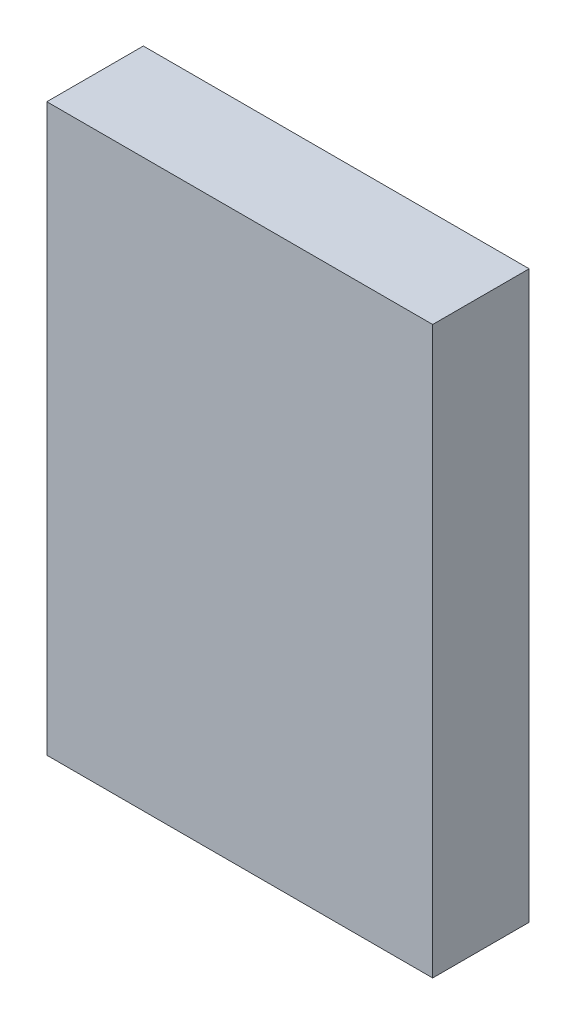
ISO-10303-21;
HEADER;
FILE_DESCRIPTION(('STEP AP214'),'2;1');
FILE_NAME('part.step','',(''),(''),'','','');
FILE_SCHEMA(('AUTOMOTIVE_DESIGN { 1 0 10303 214 1 1 1 1 }'));
ENDSEC;
DATA;
#1=APPLICATION_CONTEXT('core data for automotive mechanical design processes');
#2=APPLICATION_PROTOCOL_DEFINITION('international standard','automotive_design',2000,#1);
#3=PRODUCT_CONTEXT('',#1,'mechanical');
#4=PRODUCT('Part','Part','',(#3));
#5=PRODUCT_RELATED_PRODUCT_CATEGORY('part','',(#4));
#6=PRODUCT_DEFINITION_FORMATION('','',#4);
#7=PRODUCT_DEFINITION_CONTEXT('part definition',#1,'design');
#8=PRODUCT_DEFINITION('design','',#6,#7);
#9=PRODUCT_DEFINITION_SHAPE('','',#8);
#10=(LENGTH_UNIT() NAMED_UNIT(*) SI_UNIT(.MILLI.,.METRE.));
#11=(NAMED_UNIT(*) PLANE_ANGLE_UNIT() SI_UNIT($,.RADIAN.));
#12=(NAMED_UNIT(*) SI_UNIT($,.STERADIAN.) SOLID_ANGLE_UNIT());
#13=UNCERTAINTY_MEASURE_WITH_UNIT(LENGTH_MEASURE(1.E-05),#10,'distance_accuracy_value','');
#14=(GEOMETRIC_REPRESENTATION_CONTEXT(3) GLOBAL_UNCERTAINTY_ASSIGNED_CONTEXT((#13)) GLOBAL_UNIT_ASSIGNED_CONTEXT((#10,
#11,#12)) REPRESENTATION_CONTEXT('',''));
#15=CARTESIAN_POINT('',(0.,0.,0.));
#16=DIRECTION('',(0.,0.,1.));
#17=DIRECTION('',(1.,0.,0.));
#18=AXIS2_PLACEMENT_3D('',#15,#16,#17);
#19=CARTESIAN_POINT('',(-1.49949154,-2.19949014,0.));
#20=DIRECTION('',(0.,1.,0.));
#21=DIRECTION('',(1.,0.,0.));
#22=AXIS2_PLACEMENT_3D('',#19,#20,#21);
#23=PLANE('',#22);
#24=DIRECTION('',(1.,0.,0.));
#25=VECTOR('',#24,1.);
#26=CARTESIAN_POINT('',(-1.49949154,-2.19949014,0.));
#27=LINE('',#26,#25);
#28=CARTESIAN_POINT('',(-1.49949154,-2.19949014,0.));
#29=VERTEX_POINT('',#28);
#30=CARTESIAN_POINT('',(1.49949408,-2.19949014,0.));
#31=VERTEX_POINT('',#30);
#32=EDGE_CURVE('E11',#29,#31,#27,.T.);
#33=ORIENTED_EDGE('',*,*,#32,.T.);
#34=DIRECTION('',(0.,0.,1.));
#35=VECTOR('',#34,1.);
#36=CARTESIAN_POINT('',(1.49949408,-2.19949014,0.));
#37=LINE('',#36,#35);
#38=CARTESIAN_POINT('',(1.49949408,-2.19949014,0.75000104));
#39=VERTEX_POINT('',#38);
#40=EDGE_CURVE('E24',#31,#39,#37,.T.);
#41=ORIENTED_EDGE('',*,*,#40,.T.);
#42=DIRECTION('',(1.,0.,0.));
#43=VECTOR('',#42,1.);
#44=CARTESIAN_POINT('',(-1.49949154,-2.19949014,0.75000104));
#45=LINE('',#44,#43);
#46=CARTESIAN_POINT('',(-1.49949154,-2.19949014,0.75000104));
#47=VERTEX_POINT('',#46);
#48=EDGE_CURVE('E87',#47,#39,#45,.T.);
#49=ORIENTED_EDGE('',*,*,#48,.F.);
#50=DIRECTION('',(0.,0.,1.));
#51=VECTOR('',#50,1.);
#52=CARTESIAN_POINT('',(-1.49949154,-2.19949014,0.));
#53=LINE('',#52,#51);
#54=EDGE_CURVE('E36',#29,#47,#53,.T.);
#55=ORIENTED_EDGE('',*,*,#54,.F.);
#56=EDGE_LOOP('',(#33,#41,#49,#55));
#57=FACE_BOUND('',#56,.T.);
#58=ADVANCED_FACE('F17',(#57),#23,.F.);
#59=CARTESIAN_POINT('',(1.49949408,-2.19949014,0.));
#60=DIRECTION('',(-1.,0.,0.));
#61=DIRECTION('',(0.,1.,0.));
#62=AXIS2_PLACEMENT_3D('',#59,#60,#61);
#63=PLANE('',#62);
#64=DIRECTION('',(0.,1.,0.));
#65=VECTOR('',#64,1.);
#66=CARTESIAN_POINT('',(1.49949408,-2.19949014,0.));
#67=LINE('',#66,#65);
#68=CARTESIAN_POINT('',(1.49949408,2.19949268,0.));
#69=VERTEX_POINT('',#68);
#70=EDGE_CURVE('E84',#31,#69,#67,.T.);
#71=ORIENTED_EDGE('',*,*,#70,.T.);
#72=DIRECTION('',(0.,0.,1.));
#73=VECTOR('',#72,1.);
#74=CARTESIAN_POINT('',(1.49949408,2.19949268,0.));
#75=LINE('',#74,#73);
#76=CARTESIAN_POINT('',(1.49949408,2.19949268,0.75000104));
#77=VERTEX_POINT('',#76);
#78=EDGE_CURVE('E82',#69,#77,#75,.T.);
#79=ORIENTED_EDGE('',*,*,#78,.T.);
#80=DIRECTION('',(0.,1.,0.));
#81=VECTOR('',#80,1.);
#82=CARTESIAN_POINT('',(1.49949408,-2.19949014,0.75000104));
#83=LINE('',#82,#81);
#84=EDGE_CURVE('E62',#39,#77,#83,.T.);
#85=ORIENTED_EDGE('',*,*,#84,.F.);
#86=ORIENTED_EDGE('',*,*,#40,.F.);
#87=EDGE_LOOP('',(#71,#79,#85,#86));
#88=FACE_BOUND('',#87,.T.);
#89=ADVANCED_FACE('F89',(#88),#63,.F.);
#90=CARTESIAN_POINT('',(1.49949408,2.19949268,0.));
#91=DIRECTION('',(0.,-1.,0.));
#92=DIRECTION('',(-1.,0.,0.));
#93=AXIS2_PLACEMENT_3D('',#90,#91,#92);
#94=PLANE('',#93);
#95=DIRECTION('',(-1.,0.,0.));
#96=VECTOR('',#95,1.);
#97=CARTESIAN_POINT('',(1.49949408,2.19949268,0.));
#98=LINE('',#97,#96);
#99=CARTESIAN_POINT('',(-1.49949154,2.19949268,0.));
#100=VERTEX_POINT('',#99);
#101=EDGE_CURVE('E71',#69,#100,#98,.T.);
#102=ORIENTED_EDGE('',*,*,#101,.T.);
#103=DIRECTION('',(0.,0.,1.));
#104=VECTOR('',#103,1.);
#105=CARTESIAN_POINT('',(-1.49949154,2.19949268,0.));
#106=LINE('',#105,#104);
#107=CARTESIAN_POINT('',(-1.49949154,2.19949268,0.75000104));
#108=VERTEX_POINT('',#107);
#109=EDGE_CURVE('E65',#100,#108,#106,.T.);
#110=ORIENTED_EDGE('',*,*,#109,.T.);
#111=DIRECTION('',(-1.,0.,0.));
#112=VECTOR('',#111,1.);
#113=CARTESIAN_POINT('',(1.49949408,2.19949268,0.75000104));
#114=LINE('',#113,#112);
#115=EDGE_CURVE('E57',#77,#108,#114,.T.);
#116=ORIENTED_EDGE('',*,*,#115,.F.);
#117=ORIENTED_EDGE('',*,*,#78,.F.);
#118=EDGE_LOOP('',(#102,#110,#116,#117));
#119=FACE_BOUND('',#118,.T.);
#120=ADVANCED_FACE('F69',(#119),#94,.F.);
#121=CARTESIAN_POINT('',(-1.49949154,2.19949268,0.));
#122=DIRECTION('',(1.,0.,0.));
#123=DIRECTION('',(0.,-1.,0.));
#124=AXIS2_PLACEMENT_3D('',#121,#122,#123);
#125=PLANE('',#124);
#126=DIRECTION('',(0.,-1.,0.));
#127=VECTOR('',#126,1.);
#128=CARTESIAN_POINT('',(-1.49949154,2.19949268,0.));
#129=LINE('',#128,#127);
#130=EDGE_CURVE('E66',#100,#29,#129,.T.);
#131=ORIENTED_EDGE('',*,*,#130,.T.);
#132=ORIENTED_EDGE('',*,*,#54,.T.);
#133=DIRECTION('',(0.,-1.,0.));
#134=VECTOR('',#133,1.);
#135=CARTESIAN_POINT('',(-1.49949154,2.19949268,0.75000104));
#136=LINE('',#135,#134);
#137=EDGE_CURVE('E61',#108,#47,#136,.T.);
#138=ORIENTED_EDGE('',*,*,#137,.F.);
#139=ORIENTED_EDGE('',*,*,#109,.F.);
#140=EDGE_LOOP('',(#131,#132,#138,#139));
#141=FACE_BOUND('',#140,.T.);
#142=ADVANCED_FACE('F76',(#141),#125,.F.);
#143=CARTESIAN_POINT('',(-1.49949154,-2.19949014,0.));
#144=DIRECTION('',(0.,0.,-1.));
#145=DIRECTION('',(-1.,0.,0.));
#146=AXIS2_PLACEMENT_3D('',#143,#144,#145);
#147=PLANE('',#146);
#148=ORIENTED_EDGE('',*,*,#130,.F.);
#149=ORIENTED_EDGE('',*,*,#101,.F.);
#150=ORIENTED_EDGE('',*,*,#70,.F.);
#151=ORIENTED_EDGE('',*,*,#32,.F.);
#152=EDGE_LOOP('',(#148,#149,#150,#151));
#153=FACE_BOUND('',#152,.T.);
#154=ADVANCED_FACE('F91',(#153),#147,.T.);
#155=CARTESIAN_POINT('',(-1.49949154,-2.19949014,0.75000104));
#156=DIRECTION('',(0.,0.,-1.));
#157=DIRECTION('',(-1.,0.,0.));
#158=AXIS2_PLACEMENT_3D('',#155,#156,#157);
#159=PLANE('',#158);
#160=ORIENTED_EDGE('',*,*,#48,.T.);
#161=ORIENTED_EDGE('',*,*,#84,.T.);
#162=ORIENTED_EDGE('',*,*,#115,.T.);
#163=ORIENTED_EDGE('',*,*,#137,.T.);
#164=EDGE_LOOP('',(#160,#161,#162,#163));
#165=FACE_BOUND('',#164,.T.);
#166=ADVANCED_FACE('F59',(#165),#159,.F.);
#167=CLOSED_SHELL('',(#58,#89,#120,#142,#154,#166));
#168=MANIFOLD_SOLID_BREP('B1',#167);
#169=ADVANCED_BREP_SHAPE_REPRESENTATION('',(#18,#168),#14);
#170=SHAPE_DEFINITION_REPRESENTATION(#9,#169);
ENDSEC;
END-ISO-10303-21;
